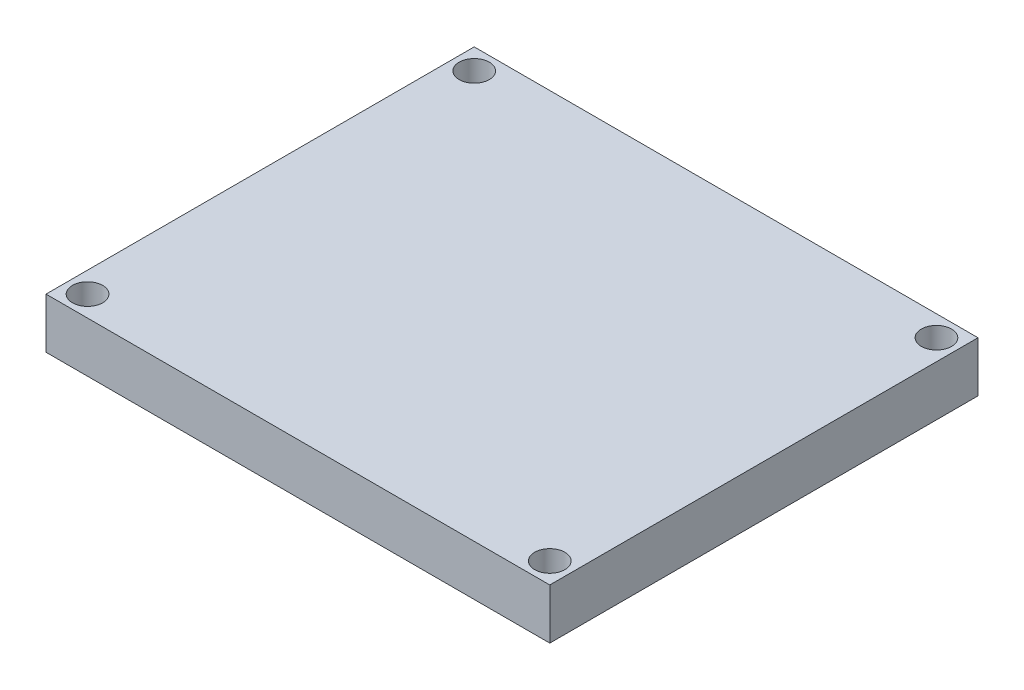
ISO-10303-21;
HEADER;
FILE_DESCRIPTION(('STEP AP214'),'2;1');
FILE_NAME('part.step','',(''),(''),'','','');
FILE_SCHEMA(('AUTOMOTIVE_DESIGN { 1 0 10303 214 1 1 1 1 }'));
ENDSEC;
DATA;
#1=APPLICATION_CONTEXT('core data for automotive mechanical design processes');
#2=APPLICATION_PROTOCOL_DEFINITION('international standard','automotive_design',2000,#1);
#3=PRODUCT_CONTEXT('',#1,'mechanical');
#4=PRODUCT('Part','Part','',(#3));
#5=PRODUCT_RELATED_PRODUCT_CATEGORY('part','',(#4));
#6=PRODUCT_DEFINITION_FORMATION('','',#4);
#7=PRODUCT_DEFINITION_CONTEXT('part definition',#1,'design');
#8=PRODUCT_DEFINITION('design','',#6,#7);
#9=PRODUCT_DEFINITION_SHAPE('','',#8);
#10=(LENGTH_UNIT() NAMED_UNIT(*) SI_UNIT(.MILLI.,.METRE.));
#11=(NAMED_UNIT(*) PLANE_ANGLE_UNIT() SI_UNIT($,.RADIAN.));
#12=(NAMED_UNIT(*) SI_UNIT($,.STERADIAN.) SOLID_ANGLE_UNIT());
#13=UNCERTAINTY_MEASURE_WITH_UNIT(LENGTH_MEASURE(1.E-05),#10,'distance_accuracy_value','');
#14=(GEOMETRIC_REPRESENTATION_CONTEXT(3) GLOBAL_UNCERTAINTY_ASSIGNED_CONTEXT((#13)) GLOBAL_UNIT_ASSIGNED_CONTEXT((#10,
#11,#12)) REPRESENTATION_CONTEXT('',''));
#15=CARTESIAN_POINT('',(0.,0.,0.));
#16=DIRECTION('',(0.,0.,1.));
#17=DIRECTION('',(1.,0.,0.));
#18=AXIS2_PLACEMENT_3D('',#15,#16,#17);
#19=CARTESIAN_POINT('',(0.,5.08,0.));
#20=DIRECTION('',(0.,-1.,0.));
#21=DIRECTION('',(0.,0.,-1.));
#22=AXIS2_PLACEMENT_3D('',#19,#20,#21);
#23=PLANE('',#22);
#24=CARTESIAN_POINT('',(-23.3045,5.08,19.4945));
#25=DIRECTION('',(0.,1.,0.));
#26=DIRECTION('',(0.,0.,1.));
#27=AXIS2_PLACEMENT_3D('',#24,#25,#26);
#28=CIRCLE('',#27,1.524);
#29=CARTESIAN_POINT('',(-23.3045,5.08,21.0185));
#30=VERTEX_POINT('',#29);
#31=EDGE_CURVE('E121',#30,#30,#28,.T.);
#32=ORIENTED_EDGE('',*,*,#31,.F.);
#33=EDGE_LOOP('',(#32));
#34=FACE_BOUND('',#33,.T.);
#35=CARTESIAN_POINT('',(-23.3045,5.08,-19.4945));
#36=DIRECTION('',(0.,1.,0.));
#37=DIRECTION('',(0.,0.,1.));
#38=AXIS2_PLACEMENT_3D('',#35,#36,#37);
#39=CIRCLE('',#38,1.524);
#40=CARTESIAN_POINT('',(-23.3045,5.08,-17.9705));
#41=VERTEX_POINT('',#40);
#42=EDGE_CURVE('E100',#41,#41,#39,.T.);
#43=ORIENTED_EDGE('',*,*,#42,.F.);
#44=EDGE_LOOP('',(#43));
#45=FACE_BOUND('',#44,.T.);
#46=DIRECTION('',(0.,0.,-1.));
#47=VECTOR('',#46,1.);
#48=CARTESIAN_POINT('',(25.4,5.08,21.59));
#49=LINE('',#48,#47);
#50=CARTESIAN_POINT('',(25.4,5.08,21.59));
#51=VERTEX_POINT('',#50);
#52=CARTESIAN_POINT('',(25.4,5.08,-21.59));
#53=VERTEX_POINT('',#52);
#54=EDGE_CURVE('E85',#51,#53,#49,.T.);
#55=ORIENTED_EDGE('',*,*,#54,.T.);
#56=DIRECTION('',(-1.,0.,0.));
#57=VECTOR('',#56,1.);
#58=CARTESIAN_POINT('',(-25.4,5.08,-21.59));
#59=LINE('',#58,#57);
#60=CARTESIAN_POINT('',(-25.4,5.08,-21.59));
#61=VERTEX_POINT('',#60);
#62=EDGE_CURVE('E80',#53,#61,#59,.T.);
#63=ORIENTED_EDGE('',*,*,#62,.T.);
#64=DIRECTION('',(0.,0.,1.));
#65=VECTOR('',#64,1.);
#66=CARTESIAN_POINT('',(-25.4,5.08,21.59));
#67=LINE('',#66,#65);
#68=CARTESIAN_POINT('',(-25.4,5.08,21.59));
#69=VERTEX_POINT('',#68);
#70=EDGE_CURVE('E83',#61,#69,#67,.T.);
#71=ORIENTED_EDGE('',*,*,#70,.T.);
#72=DIRECTION('',(1.,0.,0.));
#73=VECTOR('',#72,1.);
#74=CARTESIAN_POINT('',(-25.4,5.08,21.59));
#75=LINE('',#74,#73);
#76=EDGE_CURVE('E50',#69,#51,#75,.T.);
#77=ORIENTED_EDGE('',*,*,#76,.T.);
#78=EDGE_LOOP('',(#55,#63,#71,#77));
#79=FACE_BOUND('',#78,.T.);
#80=CARTESIAN_POINT('',(23.3045,5.08,-19.4945));
#81=DIRECTION('',(0.,1.,0.));
#82=DIRECTION('',(0.,0.,1.));
#83=AXIS2_PLACEMENT_3D('',#80,#81,#82);
#84=CIRCLE('',#83,1.524);
#85=CARTESIAN_POINT('',(23.3045,5.08,-17.9705));
#86=VERTEX_POINT('',#85);
#87=EDGE_CURVE('E115',#86,#86,#84,.T.);
#88=ORIENTED_EDGE('',*,*,#87,.F.);
#89=EDGE_LOOP('',(#88));
#90=FACE_BOUND('',#89,.T.);
#91=CARTESIAN_POINT('',(23.3045,5.08,19.4945));
#92=DIRECTION('',(0.,1.,0.));
#93=DIRECTION('',(0.,0.,1.));
#94=AXIS2_PLACEMENT_3D('',#91,#92,#93);
#95=CIRCLE('',#94,1.524);
#96=CARTESIAN_POINT('',(23.3045,5.08,21.0185));
#97=VERTEX_POINT('',#96);
#98=EDGE_CURVE('E127',#97,#97,#95,.T.);
#99=ORIENTED_EDGE('',*,*,#98,.F.);
#100=EDGE_LOOP('',(#99));
#101=FACE_BOUND('',#100,.T.);
#102=ADVANCED_FACE('F33',(#34,#45,#79,#90,#101),#23,.F.);
#103=CARTESIAN_POINT('',(0.,0.,0.));
#104=DIRECTION('',(0.,-1.,0.));
#105=DIRECTION('',(0.,0.,-1.));
#106=AXIS2_PLACEMENT_3D('',#103,#104,#105);
#107=PLANE('',#106);
#108=CARTESIAN_POINT('',(-23.3045,0.,19.4945));
#109=DIRECTION('',(0.,1.,0.));
#110=DIRECTION('',(0.,0.,1.));
#111=AXIS2_PLACEMENT_3D('',#108,#109,#110);
#112=CIRCLE('',#111,1.524);
#113=CARTESIAN_POINT('',(-23.3045,0.,21.0185));
#114=VERTEX_POINT('',#113);
#115=EDGE_CURVE('E124',#114,#114,#112,.T.);
#116=ORIENTED_EDGE('',*,*,#115,.T.);
#117=EDGE_LOOP('',(#116));
#118=FACE_BOUND('',#117,.T.);
#119=CARTESIAN_POINT('',(-23.3045,0.,-19.4945));
#120=DIRECTION('',(0.,1.,0.));
#121=DIRECTION('',(0.,0.,1.));
#122=AXIS2_PLACEMENT_3D('',#119,#120,#121);
#123=CIRCLE('',#122,1.524);
#124=CARTESIAN_POINT('',(-23.3045,0.,-17.9705));
#125=VERTEX_POINT('',#124);
#126=EDGE_CURVE('E112',#125,#125,#123,.T.);
#127=ORIENTED_EDGE('',*,*,#126,.T.);
#128=EDGE_LOOP('',(#127));
#129=FACE_BOUND('',#128,.T.);
#130=DIRECTION('',(0.,0.,-1.));
#131=VECTOR('',#130,1.);
#132=CARTESIAN_POINT('',(25.4,0.,21.59));
#133=LINE('',#132,#131);
#134=CARTESIAN_POINT('',(25.4,0.,21.59));
#135=VERTEX_POINT('',#134);
#136=CARTESIAN_POINT('',(25.4,0.,-21.59));
#137=VERTEX_POINT('',#136);
#138=EDGE_CURVE('E97',#135,#137,#133,.T.);
#139=ORIENTED_EDGE('',*,*,#138,.F.);
#140=DIRECTION('',(1.,0.,0.));
#141=VECTOR('',#140,1.);
#142=CARTESIAN_POINT('',(-25.4,0.,21.59));
#143=LINE('',#142,#141);
#144=CARTESIAN_POINT('',(-25.4,0.,21.59));
#145=VERTEX_POINT('',#144);
#146=EDGE_CURVE('E73',#145,#135,#143,.T.);
#147=ORIENTED_EDGE('',*,*,#146,.F.);
#148=DIRECTION('',(0.,0.,1.));
#149=VECTOR('',#148,1.);
#150=CARTESIAN_POINT('',(-25.4,0.,21.59));
#151=LINE('',#150,#149);
#152=CARTESIAN_POINT('',(-25.4,0.,-21.59));
#153=VERTEX_POINT('',#152);
#154=EDGE_CURVE('E67',#153,#145,#151,.T.);
#155=ORIENTED_EDGE('',*,*,#154,.F.);
#156=DIRECTION('',(-1.,0.,0.));
#157=VECTOR('',#156,1.);
#158=CARTESIAN_POINT('',(-25.4,0.,-21.59));
#159=LINE('',#158,#157);
#160=EDGE_CURVE('E89',#137,#153,#159,.T.);
#161=ORIENTED_EDGE('',*,*,#160,.F.);
#162=EDGE_LOOP('',(#139,#147,#155,#161));
#163=FACE_BOUND('',#162,.T.);
#164=CARTESIAN_POINT('',(23.3045,0.,-19.4945));
#165=DIRECTION('',(0.,1.,0.));
#166=DIRECTION('',(0.,0.,1.));
#167=AXIS2_PLACEMENT_3D('',#164,#165,#166);
#168=CIRCLE('',#167,1.524);
#169=CARTESIAN_POINT('',(23.3045,0.,-17.9705));
#170=VERTEX_POINT('',#169);
#171=EDGE_CURVE('E118',#170,#170,#168,.T.);
#172=ORIENTED_EDGE('',*,*,#171,.T.);
#173=EDGE_LOOP('',(#172));
#174=FACE_BOUND('',#173,.T.);
#175=CARTESIAN_POINT('',(23.3045,0.,19.4945));
#176=DIRECTION('',(0.,1.,0.));
#177=DIRECTION('',(0.,0.,1.));
#178=AXIS2_PLACEMENT_3D('',#175,#176,#177);
#179=CIRCLE('',#178,1.524);
#180=CARTESIAN_POINT('',(23.3045,0.,21.0185));
#181=VERTEX_POINT('',#180);
#182=EDGE_CURVE('E130',#181,#181,#179,.T.);
#183=ORIENTED_EDGE('',*,*,#182,.T.);
#184=EDGE_LOOP('',(#183));
#185=FACE_BOUND('',#184,.T.);
#186=ADVANCED_FACE('F108',(#118,#129,#163,#174,#185),#107,.T.);
#187=CARTESIAN_POINT('',(25.4,5.08,21.59));
#188=DIRECTION('',(-1.,0.,0.));
#189=DIRECTION('',(0.,0.,1.));
#190=AXIS2_PLACEMENT_3D('',#187,#188,#189);
#191=PLANE('',#190);
#192=ORIENTED_EDGE('',*,*,#138,.T.);
#193=DIRECTION('',(0.,-1.,0.));
#194=VECTOR('',#193,1.);
#195=CARTESIAN_POINT('',(25.4,5.08,-21.59));
#196=LINE('',#195,#194);
#197=EDGE_CURVE('E11',#53,#137,#196,.T.);
#198=ORIENTED_EDGE('',*,*,#197,.F.);
#199=ORIENTED_EDGE('',*,*,#54,.F.);
#200=DIRECTION('',(0.,-1.,0.));
#201=VECTOR('',#200,1.);
#202=CARTESIAN_POINT('',(25.4,5.08,21.59));
#203=LINE('',#202,#201);
#204=EDGE_CURVE('E93',#51,#135,#203,.T.);
#205=ORIENTED_EDGE('',*,*,#204,.T.);
#206=EDGE_LOOP('',(#192,#198,#199,#205));
#207=FACE_BOUND('',#206,.T.);
#208=ADVANCED_FACE('F35',(#207),#191,.F.);
#209=CARTESIAN_POINT('',(-25.4,5.08,-21.59));
#210=DIRECTION('',(0.,0.,1.));
#211=DIRECTION('',(1.,0.,0.));
#212=AXIS2_PLACEMENT_3D('',#209,#210,#211);
#213=PLANE('',#212);
#214=ORIENTED_EDGE('',*,*,#160,.T.);
#215=DIRECTION('',(0.,-1.,0.));
#216=VECTOR('',#215,1.);
#217=CARTESIAN_POINT('',(-25.4,5.08,-21.59));
#218=LINE('',#217,#216);
#219=EDGE_CURVE('E42',#61,#153,#218,.T.);
#220=ORIENTED_EDGE('',*,*,#219,.F.);
#221=ORIENTED_EDGE('',*,*,#62,.F.);
#222=ORIENTED_EDGE('',*,*,#197,.T.);
#223=EDGE_LOOP('',(#214,#220,#221,#222));
#224=FACE_BOUND('',#223,.T.);
#225=ADVANCED_FACE('F88',(#224),#213,.F.);
#226=CARTESIAN_POINT('',(-25.4,5.08,21.59));
#227=DIRECTION('',(1.,0.,0.));
#228=DIRECTION('',(0.,0.,-1.));
#229=AXIS2_PLACEMENT_3D('',#226,#227,#228);
#230=PLANE('',#229);
#231=ORIENTED_EDGE('',*,*,#154,.T.);
#232=DIRECTION('',(0.,-1.,0.));
#233=VECTOR('',#232,1.);
#234=CARTESIAN_POINT('',(-25.4,5.08,21.59));
#235=LINE('',#234,#233);
#236=EDGE_CURVE('E90',#69,#145,#235,.T.);
#237=ORIENTED_EDGE('',*,*,#236,.F.);
#238=ORIENTED_EDGE('',*,*,#70,.F.);
#239=ORIENTED_EDGE('',*,*,#219,.T.);
#240=EDGE_LOOP('',(#231,#237,#238,#239));
#241=FACE_BOUND('',#240,.T.);
#242=ADVANCED_FACE('F91',(#241),#230,.F.);
#243=CARTESIAN_POINT('',(-25.4,5.08,21.59));
#244=DIRECTION('',(0.,0.,-1.));
#245=DIRECTION('',(-1.,0.,0.));
#246=AXIS2_PLACEMENT_3D('',#243,#244,#245);
#247=PLANE('',#246);
#248=ORIENTED_EDGE('',*,*,#146,.T.);
#249=ORIENTED_EDGE('',*,*,#204,.F.);
#250=ORIENTED_EDGE('',*,*,#76,.F.);
#251=ORIENTED_EDGE('',*,*,#236,.T.);
#252=EDGE_LOOP('',(#248,#249,#250,#251));
#253=FACE_BOUND('',#252,.T.);
#254=ADVANCED_FACE('F105',(#253),#247,.F.);
#255=CARTESIAN_POINT('',(-23.3045,5.08,-19.4945));
#256=DIRECTION('',(0.,-1.,0.));
#257=DIRECTION('',(0.,0.,-1.));
#258=AXIS2_PLACEMENT_3D('',#255,#256,#257);
#259=CYLINDRICAL_SURFACE('',#258,1.524);
#260=ORIENTED_EDGE('',*,*,#42,.T.);
#261=EDGE_LOOP('',(#260));
#262=FACE_BOUND('',#261,.T.);
#263=ORIENTED_EDGE('',*,*,#126,.F.);
#264=EDGE_LOOP('',(#263));
#265=FACE_BOUND('',#264,.T.);
#266=ADVANCED_FACE('F150',(#262,#265),#259,.F.);
#267=CARTESIAN_POINT('',(23.3045,5.08,-19.4945));
#268=DIRECTION('',(0.,-1.,0.));
#269=DIRECTION('',(0.,0.,-1.));
#270=AXIS2_PLACEMENT_3D('',#267,#268,#269);
#271=CYLINDRICAL_SURFACE('',#270,1.524);
#272=ORIENTED_EDGE('',*,*,#87,.T.);
#273=EDGE_LOOP('',(#272));
#274=FACE_BOUND('',#273,.T.);
#275=ORIENTED_EDGE('',*,*,#171,.F.);
#276=EDGE_LOOP('',(#275));
#277=FACE_BOUND('',#276,.T.);
#278=ADVANCED_FACE('F196',(#274,#277),#271,.F.);
#279=CARTESIAN_POINT('',(-23.3045,5.08,19.4945));
#280=DIRECTION('',(0.,-1.,0.));
#281=DIRECTION('',(0.,0.,-1.));
#282=AXIS2_PLACEMENT_3D('',#279,#280,#281);
#283=CYLINDRICAL_SURFACE('',#282,1.524);
#284=ORIENTED_EDGE('',*,*,#31,.T.);
#285=EDGE_LOOP('',(#284));
#286=FACE_BOUND('',#285,.T.);
#287=ORIENTED_EDGE('',*,*,#115,.F.);
#288=EDGE_LOOP('',(#287));
#289=FACE_BOUND('',#288,.T.);
#290=ADVANCED_FACE('F204',(#286,#289),#283,.F.);
#291=CARTESIAN_POINT('',(23.3045,5.08,19.4945));
#292=DIRECTION('',(0.,-1.,0.));
#293=DIRECTION('',(0.,0.,-1.));
#294=AXIS2_PLACEMENT_3D('',#291,#292,#293);
#295=CYLINDRICAL_SURFACE('',#294,1.524);
#296=ORIENTED_EDGE('',*,*,#98,.T.);
#297=EDGE_LOOP('',(#296));
#298=FACE_BOUND('',#297,.T.);
#299=ORIENTED_EDGE('',*,*,#182,.F.);
#300=EDGE_LOOP('',(#299));
#301=FACE_BOUND('',#300,.T.);
#302=ADVANCED_FACE('F136',(#298,#301),#295,.F.);
#303=CLOSED_SHELL('',(#102,#186,#208,#225,#242,#254,#266,#278,#290,#302));
#304=MANIFOLD_SOLID_BREP('B2',#303);
#305=ADVANCED_BREP_SHAPE_REPRESENTATION('',(#18,#304),#14);
#306=SHAPE_DEFINITION_REPRESENTATION(#9,#305);
ENDSEC;
END-ISO-10303-21;
